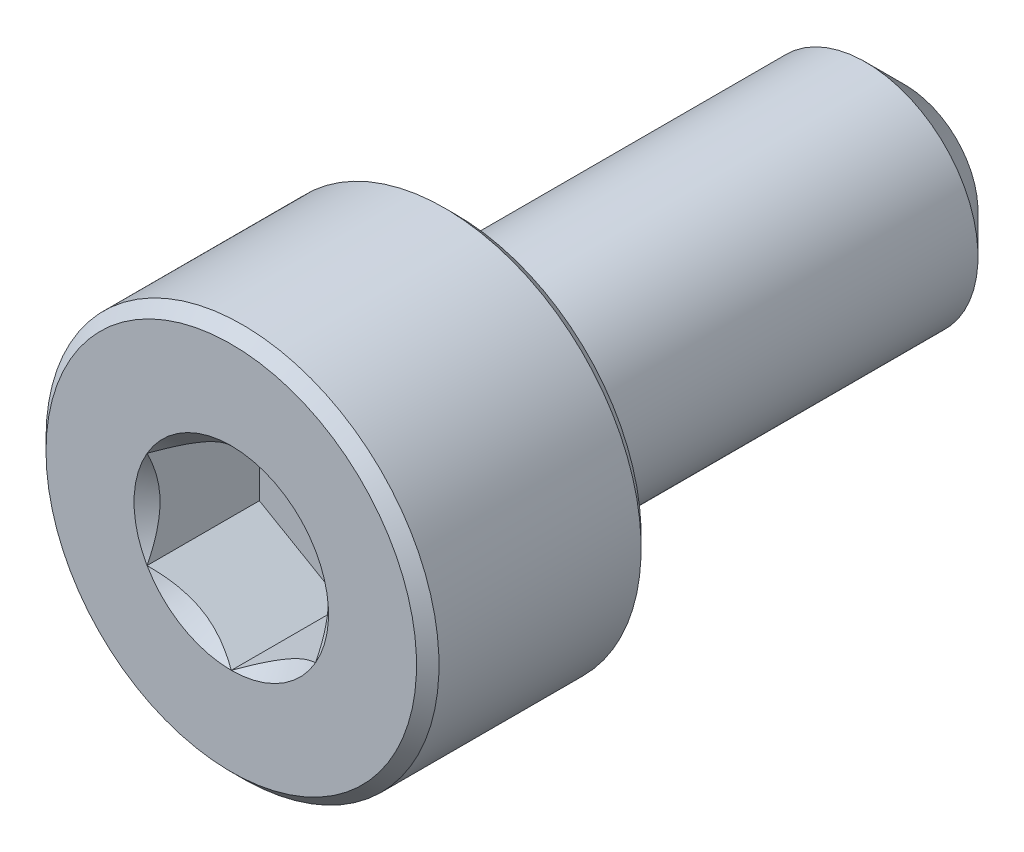
ISO-10303-21;
HEADER;
FILE_DESCRIPTION(('STEP AP214'),'2;1');
FILE_NAME('part.step','',(''),(''),'','','');
FILE_SCHEMA(('AUTOMOTIVE_DESIGN { 1 0 10303 214 1 1 1 1 }'));
ENDSEC;
DATA;
#1=APPLICATION_CONTEXT('core data for automotive mechanical design processes');
#2=APPLICATION_PROTOCOL_DEFINITION('international standard','automotive_design',2000,#1);
#3=PRODUCT_CONTEXT('',#1,'mechanical');
#4=PRODUCT('Part','Part','',(#3));
#5=PRODUCT_RELATED_PRODUCT_CATEGORY('part','',(#4));
#6=PRODUCT_DEFINITION_FORMATION('','',#4);
#7=PRODUCT_DEFINITION_CONTEXT('part definition',#1,'design');
#8=PRODUCT_DEFINITION('design','',#6,#7);
#9=PRODUCT_DEFINITION_SHAPE('','',#8);
#10=(LENGTH_UNIT() NAMED_UNIT(*) SI_UNIT(.MILLI.,.METRE.));
#11=(NAMED_UNIT(*) PLANE_ANGLE_UNIT() SI_UNIT($,.RADIAN.));
#12=(NAMED_UNIT(*) SI_UNIT($,.STERADIAN.) SOLID_ANGLE_UNIT());
#13=UNCERTAINTY_MEASURE_WITH_UNIT(LENGTH_MEASURE(1.E-05),#10,'distance_accuracy_value','');
#14=(GEOMETRIC_REPRESENTATION_CONTEXT(3) GLOBAL_UNCERTAINTY_ASSIGNED_CONTEXT((#13)) GLOBAL_UNIT_ASSIGNED_CONTEXT((#10,
#11,#12)) REPRESENTATION_CONTEXT('',''));
#15=CARTESIAN_POINT('',(0.,0.,0.));
#16=DIRECTION('',(0.,0.,1.));
#17=DIRECTION('',(1.,0.,0.));
#18=AXIS2_PLACEMENT_3D('',#15,#16,#17);
#19=CARTESIAN_POINT('',(0.,3.3,6.));
#20=DIRECTION('',(0.,0.,1.));
#21=DIRECTION('',(1.,0.,0.));
#22=AXIS2_PLACEMENT_3D('',#19,#20,#21);
#23=PLANE('',#22);
#24=CARTESIAN_POINT('',(0.,0.,6.));
#25=DIRECTION('',(0.,0.,1.));
#26=DIRECTION('',(1.,0.,0.));
#27=AXIS2_PLACEMENT_3D('',#24,#25,#26);
#28=CIRCLE('',#27,1.73205080756888);
#29=CARTESIAN_POINT('',(1.5,0.86602540378444,6.));
#30=VERTEX_POINT('',#29);
#31=CARTESIAN_POINT('',(0.,1.73205080756888,6.));
#32=VERTEX_POINT('',#31);
#33=EDGE_CURVE('E93',#30,#32,#28,.T.);
#34=ORIENTED_EDGE('',*,*,#33,.F.);
#35=CARTESIAN_POINT('',(1.5,-0.86602540378444,6.));
#36=VERTEX_POINT('',#35);
#37=EDGE_CURVE('E53',#36,#30,#28,.T.);
#38=ORIENTED_EDGE('',*,*,#37,.F.);
#39=CARTESIAN_POINT('',(0.,-1.73205080756888,6.));
#40=VERTEX_POINT('',#39);
#41=EDGE_CURVE('E279',#40,#36,#28,.T.);
#42=ORIENTED_EDGE('',*,*,#41,.F.);
#43=CARTESIAN_POINT('',(-1.5,-0.866025403784437,6.));
#44=VERTEX_POINT('',#43);
#45=EDGE_CURVE('E60',#44,#40,#28,.T.);
#46=ORIENTED_EDGE('',*,*,#45,.F.);
#47=CARTESIAN_POINT('',(-1.5,0.86602540378444,6.));
#48=VERTEX_POINT('',#47);
#49=EDGE_CURVE('E129',#48,#44,#28,.T.);
#50=ORIENTED_EDGE('',*,*,#49,.F.);
#51=EDGE_CURVE('E102',#32,#48,#28,.T.);
#52=ORIENTED_EDGE('',*,*,#51,.F.);
#53=EDGE_LOOP('',(#34,#38,#42,#46,#50,#52));
#54=FACE_BOUND('',#53,.T.);
#55=CARTESIAN_POINT('',(0.,0.,6.));
#56=DIRECTION('',(0.,0.,-1.));
#57=DIRECTION('',(-1.,0.,0.));
#58=AXIS2_PLACEMENT_3D('',#55,#56,#57);
#59=CIRCLE('',#58,3.3);
#60=CARTESIAN_POINT('',(-3.3,0.,6.));
#61=VERTEX_POINT('',#60);
#62=EDGE_CURVE('E47',#61,#61,#59,.T.);
#63=ORIENTED_EDGE('',*,*,#62,.F.);
#64=EDGE_LOOP('',(#63));
#65=FACE_BOUND('',#64,.T.);
#66=ADVANCED_FACE('F34',(#54,#65),#23,.T.);
#67=CARTESIAN_POINT('',(0.,0.,5.8));
#68=DIRECTION('',(0.,0.,-1.));
#69=DIRECTION('',(-1.,0.,0.));
#70=AXIS2_PLACEMENT_3D('',#67,#68,#69);
#71=CONICAL_SURFACE('',#70,3.5,0.785398163397445);
#72=ORIENTED_EDGE('',*,*,#62,.T.);
#73=EDGE_LOOP('',(#72));
#74=FACE_BOUND('',#73,.T.);
#75=CARTESIAN_POINT('',(0.,0.,5.8));
#76=DIRECTION('',(0.,0.,-1.));
#77=DIRECTION('',(-1.,0.,0.));
#78=AXIS2_PLACEMENT_3D('',#75,#76,#77);
#79=CIRCLE('',#78,3.5);
#80=CARTESIAN_POINT('',(-3.5,0.,5.8));
#81=VERTEX_POINT('',#80);
#82=EDGE_CURVE('E213',#81,#81,#79,.T.);
#83=ORIENTED_EDGE('',*,*,#82,.F.);
#84=EDGE_LOOP('',(#83));
#85=FACE_BOUND('',#84,.T.);
#86=ADVANCED_FACE('F218',(#74,#85),#71,.T.);
#87=CARTESIAN_POINT('',(0.,0.,-6.));
#88=DIRECTION('',(0.,0.,-1.));
#89=DIRECTION('',(-1.,0.,0.));
#90=AXIS2_PLACEMENT_3D('',#87,#88,#89);
#91=CYLINDRICAL_SURFACE('',#90,3.5);
#92=ORIENTED_EDGE('',*,*,#82,.T.);
#93=EDGE_LOOP('',(#92));
#94=FACE_BOUND('',#93,.T.);
#95=CARTESIAN_POINT('',(0.,0.,2.2));
#96=DIRECTION('',(0.,0.,-1.));
#97=DIRECTION('',(-1.,0.,0.));
#98=AXIS2_PLACEMENT_3D('',#95,#96,#97);
#99=CIRCLE('',#98,3.5);
#100=CARTESIAN_POINT('',(-3.5,0.,2.2));
#101=VERTEX_POINT('',#100);
#102=EDGE_CURVE('E210',#101,#101,#99,.T.);
#103=ORIENTED_EDGE('',*,*,#102,.F.);
#104=EDGE_LOOP('',(#103));
#105=FACE_BOUND('',#104,.T.);
#106=ADVANCED_FACE('F224',(#94,#105),#91,.T.);
#107=CARTESIAN_POINT('',(0.,0.,2.));
#108=DIRECTION('',(0.,0.,1.));
#109=DIRECTION('',(1.,0.,0.));
#110=AXIS2_PLACEMENT_3D('',#107,#108,#109);
#111=CONICAL_SURFACE('',#110,3.3,0.785398163397447);
#112=ORIENTED_EDGE('',*,*,#102,.T.);
#113=EDGE_LOOP('',(#112));
#114=FACE_BOUND('',#113,.T.);
#115=CARTESIAN_POINT('',(0.,0.,2.));
#116=DIRECTION('',(0.,0.,-1.));
#117=DIRECTION('',(-1.,0.,0.));
#118=AXIS2_PLACEMENT_3D('',#115,#116,#117);
#119=CIRCLE('',#118,3.3);
#120=CARTESIAN_POINT('',(-3.3,0.,2.));
#121=VERTEX_POINT('',#120);
#122=EDGE_CURVE('E207',#121,#121,#119,.T.);
#123=ORIENTED_EDGE('',*,*,#122,.F.);
#124=EDGE_LOOP('',(#123));
#125=FACE_BOUND('',#124,.T.);
#126=ADVANCED_FACE('F228',(#114,#125),#111,.T.);
#127=CARTESIAN_POINT('',(0.,3.3,2.));
#128=DIRECTION('',(0.,0.,-1.));
#129=DIRECTION('',(-1.,0.,0.));
#130=AXIS2_PLACEMENT_3D('',#127,#128,#129);
#131=PLANE('',#130);
#132=ORIENTED_EDGE('',*,*,#122,.T.);
#133=EDGE_LOOP('',(#132));
#134=FACE_BOUND('',#133,.T.);
#135=CARTESIAN_POINT('',(0.,0.,2.));
#136=DIRECTION('',(0.,0.,-1.));
#137=DIRECTION('',(-1.,0.,0.));
#138=AXIS2_PLACEMENT_3D('',#135,#136,#137);
#139=CIRCLE('',#138,2.);
#140=CARTESIAN_POINT('',(-2.,0.,2.));
#141=VERTEX_POINT('',#140);
#142=EDGE_CURVE('E204',#141,#141,#139,.T.);
#143=ORIENTED_EDGE('',*,*,#142,.F.);
#144=EDGE_LOOP('',(#143));
#145=FACE_BOUND('',#144,.T.);
#146=ADVANCED_FACE('F234',(#134,#145),#131,.T.);
#147=CARTESIAN_POINT('',(0.,0.,-6.));
#148=DIRECTION('',(0.,0.,-1.));
#149=DIRECTION('',(-1.,0.,0.));
#150=AXIS2_PLACEMENT_3D('',#147,#148,#149);
#151=CYLINDRICAL_SURFACE('',#150,2.);
#152=ORIENTED_EDGE('',*,*,#142,.T.);
#153=EDGE_LOOP('',(#152));
#154=FACE_BOUND('',#153,.T.);
#155=CARTESIAN_POINT('',(0.,0.,-5.29999999999999));
#156=DIRECTION('',(0.,0.,-1.));
#157=DIRECTION('',(-1.,0.,0.));
#158=AXIS2_PLACEMENT_3D('',#155,#156,#157);
#159=CIRCLE('',#158,2.);
#160=CARTESIAN_POINT('',(-2.,0.,-5.29999999999999));
#161=VERTEX_POINT('',#160);
#162=EDGE_CURVE('E201',#161,#161,#159,.T.);
#163=ORIENTED_EDGE('',*,*,#162,.F.);
#164=EDGE_LOOP('',(#163));
#165=FACE_BOUND('',#164,.T.);
#166=ADVANCED_FACE('F238',(#154,#165),#151,.T.);
#167=CARTESIAN_POINT('',(0.,0.,-6.));
#168=DIRECTION('',(0.,0.,1.));
#169=DIRECTION('',(1.,0.,0.));
#170=AXIS2_PLACEMENT_3D('',#167,#168,#169);
#171=CONICAL_SURFACE('',#170,1.3,0.785398163397443);
#172=ORIENTED_EDGE('',*,*,#162,.T.);
#173=EDGE_LOOP('',(#172));
#174=FACE_BOUND('',#173,.T.);
#175=CARTESIAN_POINT('',(0.,0.,-6.));
#176=DIRECTION('',(0.,0.,-1.));
#177=DIRECTION('',(-1.,0.,0.));
#178=AXIS2_PLACEMENT_3D('',#175,#176,#177);
#179=CIRCLE('',#178,1.3);
#180=CARTESIAN_POINT('',(-1.3,0.,-6.));
#181=VERTEX_POINT('',#180);
#182=EDGE_CURVE('E189',#181,#181,#179,.T.);
#183=ORIENTED_EDGE('',*,*,#182,.F.);
#184=EDGE_LOOP('',(#183));
#185=FACE_BOUND('',#184,.T.);
#186=ADVANCED_FACE('F241',(#174,#185),#171,.T.);
#187=CARTESIAN_POINT('',(0.,1.3,-6.));
#188=DIRECTION('',(0.,0.,-1.));
#189=DIRECTION('',(-1.,0.,0.));
#190=AXIS2_PLACEMENT_3D('',#187,#188,#189);
#191=PLANE('',#190);
#192=ORIENTED_EDGE('',*,*,#182,.T.);
#193=EDGE_LOOP('',(#192));
#194=FACE_BOUND('',#193,.T.);
#195=ADVANCED_FACE('F162',(#194),#191,.T.);
#196=CARTESIAN_POINT('',(0.,0.,6.));
#197=DIRECTION('',(0.,0.,1.));
#198=DIRECTION('',(1.,0.,0.));
#199=AXIS2_PLACEMENT_3D('',#196,#197,#198);
#200=CONICAL_SURFACE('',#199,1.73205080756888,0.78539816339745);
#201=ORIENTED_EDGE('',*,*,#51,.T.);
#202=CARTESIAN_POINT('',(0.000200000000000415,1.73216627762272,6.00011548160007));
#203=CARTESIAN_POINT('',(-0.0513677907370752,1.70239359975915,5.97036547606733));
#204=CARTESIAN_POINT('',(-0.1037979176652,1.67212305186355,5.94236248391031));
#205=CARTESIAN_POINT('',(-0.210709034055596,1.61039789003619,5.89108923044014));
#206=CARTESIAN_POINT('',(-0.265200195814661,1.57893740312614,5.86784750504437));
#207=CARTESIAN_POINT('',(-0.375079081357248,1.51549879897987,5.82803372899222));
#208=CARTESIAN_POINT('',(-0.430438809095199,1.4835368452681,5.8113615856709));
#209=CARTESIAN_POINT('',(-0.54237725747715,1.41890915196211,5.7856744568181));
#210=CARTESIAN_POINT('',(-0.598952556553008,1.38624538781118,5.77664029047887));
#211=CARTESIAN_POINT('',(-0.69645538951644,1.329952100953,5.76848908122685));
#212=CARTESIAN_POINT('',(-0.737256908280466,1.30639533311124,5.76728225298922));
#213=CARTESIAN_POINT('',(-0.818787969615858,1.25932335290193,5.76931405716227));
#214=CARTESIAN_POINT('',(-0.85951749431463,1.23580815085313,5.77255367074831));
#215=CARTESIAN_POINT('',(-0.940584402163416,1.18900414978427,5.78329198598196));
#216=CARTESIAN_POINT('',(-0.980921384598288,1.1657155821172,5.79079465301873));
#217=CARTESIAN_POINT('',(-1.06091833691403,1.11952932016335,5.80965161192829));
#218=CARTESIAN_POINT('',(-1.10057800851621,1.09663179808786,5.82100755701859));
#219=CARTESIAN_POINT('',(-1.20216313477448,1.03798159809698,5.85472164759267));
#220=CARTESIAN_POINT('',(-1.26345855370969,1.00259267147465,5.87962184909337));
#221=CARTESIAN_POINT('',(-1.35358562846331,0.950557780604375,5.92165665327158));
#222=CARTESIAN_POINT('',(-1.38328513990772,0.933410759677148,5.9364251535591));
#223=CARTESIAN_POINT('',(-1.44213790138375,0.899432101996407,5.96731056594017));
#224=CARTESIAN_POINT('',(-1.47129140422064,0.88260031928571,5.98342683412171));
#225=CARTESIAN_POINT('',(-1.5002,0.865909933730601,6.00011548160007));
#226=B_SPLINE_CURVE_WITH_KNOTS('',3,(#202,#203,#204,#205,#206,#207,#208,#209,#210,#211,#212,
#213,#214,#215,#216,#217,#218,#219,#220,#221,#222,#223,#224,#225),.UNSPECIFIED.,.F.,.F.,(4,2,2,
2,2,2,2,2,2,2,2,4),(0.,0.199829143693305,0.400822987382389,0.598623720538181,0.795926240188889,
0.937113067959881,1.07833105577193,1.21968061668222,1.36109089931054,1.58570969637565,
1.69770705470964,1.80965120737194),.UNSPECIFIED.);
#227=EDGE_CURVE('E11',#32,#48,#226,.T.);
#228=ORIENTED_EDGE('',*,*,#227,.F.);
#229=EDGE_LOOP('',(#201,#228));
#230=FACE_BOUND('',#229,.T.);
#231=ADVANCED_FACE('F106',(#230),#200,.F.);
#232=ORIENTED_EDGE('',*,*,#49,.T.);
#233=CARTESIAN_POINT('',(-1.5,-1.70094076570699,6.53581150933748));
#234=CARTESIAN_POINT('',(-1.5,-1.65940339844307,6.50466245356307));
#235=CARTESIAN_POINT('',(-1.5,-1.61763176138548,6.47382664603814));
#236=CARTESIAN_POINT('',(-1.5,-1.53352581710889,6.41291005817041));
#237=CARTESIAN_POINT('',(-1.5,-1.49119136858461,6.38282947313436));
#238=CARTESIAN_POINT('',(-1.5,-1.36258344501966,6.29348482963313));
#239=CARTESIAN_POINT('',(-1.5,-1.27533705988673,6.23559781348778));
#240=CARTESIAN_POINT('',(-1.5,-1.09255216894207,6.12219567429685));
#241=CARTESIAN_POINT('',(-1.5,-0.996821581803492,6.06698654757307));
#242=CARTESIAN_POINT('',(-1.5,-0.800613082291591,5.9661637894456));
#243=CARTESIAN_POINT('',(-1.5,-0.700152604862087,5.92051785177961));
#244=CARTESIAN_POINT('',(-1.5,-0.549105960820994,5.86468252969871));
#245=CARTESIAN_POINT('',(-1.5,-0.50070074362804,5.84861439232622));
#246=CARTESIAN_POINT('',(-1.5,-0.40274469507941,5.82036772251469));
#247=CARTESIAN_POINT('',(-1.5,-0.353193782853662,5.80818946555124));
#248=CARTESIAN_POINT('',(-1.5,-0.254057869430008,5.78855091399036));
#249=CARTESIAN_POINT('',(-1.5,-0.204488814603775,5.78101136158588));
#250=CARTESIAN_POINT('',(-1.5,-0.104849462627796,5.77079321692886));
#251=CARTESIAN_POINT('',(-1.5,-0.054779247575758,5.76811384119743));
#252=CARTESIAN_POINT('',(-1.5,0.0436737229088438,5.76780462686181));
#253=CARTESIAN_POINT('',(-1.5,0.0920560164094801,5.77000633072589));
#254=CARTESIAN_POINT('',(-1.5,0.188397733218518,5.77897258823616));
#255=CARTESIAN_POINT('',(-1.5,0.236357072029981,5.78573803359405));
#256=CARTESIAN_POINT('',(-1.5,0.332310053939587,5.80358163901288));
#257=CARTESIAN_POINT('',(-1.5,0.380290051019947,5.81473209678684));
#258=CARTESIAN_POINT('',(-1.5,0.475204866701384,5.84076106187732));
#259=CARTESIAN_POINT('',(-1.5,0.52213978119671,5.85563922560084));
#260=CARTESIAN_POINT('',(-1.5,0.671135849237721,5.90843439268167));
#261=CARTESIAN_POINT('',(-1.5,0.771043708402958,5.95241449643641));
#262=CARTESIAN_POINT('',(-1.5,0.96615432077171,6.05016194816059));
#263=CARTESIAN_POINT('',(-1.5,1.06133841027248,6.10396471049644));
#264=CARTESIAN_POINT('',(-1.5,1.24322962123133,6.21492426634355));
#265=CARTESIAN_POINT('',(-1.5,1.33012275327054,6.27177988846287));
#266=CARTESIAN_POINT('',(-1.5,1.45814294533514,6.35965573982338));
#267=CARTESIAN_POINT('',(-1.5,1.50026316125082,6.38925424362582));
#268=CARTESIAN_POINT('',(-1.5,1.58392901779071,6.44922957252824));
#269=CARTESIAN_POINT('',(-1.5,1.62547481197907,6.47960618316485));
#270=CARTESIAN_POINT('',(-1.5,1.66678158585385,6.51030528702036));
#271=B_SPLINE_CURVE_WITH_KNOTS('',3,(#233,#234,#235,#236,#237,#238,#239,#240,#241,#242,#243,
#244,#245,#246,#247,#248,#249,#250,#251,#252,#253,#254,#255,#256,#257,#258,#259,#260,#261,#262,
#263,#264,#265,#266,#267,#268,#269,#270),.UNSPECIFIED.,.F.,.F.,(4,2,2,2,2,2,2,2,2,2,2,2,2,2,2,2,
2,2,4),(0.,0.155753948201002,0.311547769199354,0.625513832410582,0.956763614654479,
1.28687565594417,1.43975300144579,1.59264117109685,1.74283872260253,1.89301205954152,
2.03808349452257,2.1831832832956,2.33078307442231,2.47836926586908,2.80488410158813,
3.13260026706957,3.44396956433299,3.59840353500356,3.75279538879849),.UNSPECIFIED.);
#272=EDGE_CURVE('E101',#48,#44,#271,.F.);
#273=ORIENTED_EDGE('',*,*,#272,.F.);
#274=EDGE_LOOP('',(#232,#273));
#275=FACE_BOUND('',#274,.T.);
#276=ADVANCED_FACE('F256',(#275),#200,.F.);
#277=ORIENTED_EDGE('',*,*,#45,.T.);
#278=CARTESIAN_POINT('',(-1.5002,-0.865909933730601,6.00011548160007));
#279=CARTESIAN_POINT('',(-1.44863220926292,-0.895682611594166,5.97036547606733));
#280=CARTESIAN_POINT('',(-1.3962020823348,-0.925953159489765,5.94236248391031));
#281=CARTESIAN_POINT('',(-1.2892909659444,-0.987678321317124,5.89108923044014));
#282=CARTESIAN_POINT('',(-1.23479980418534,-1.01913880822717,5.86784750504437));
#283=CARTESIAN_POINT('',(-1.12492091864275,-1.08257741237344,5.82803372899222));
#284=CARTESIAN_POINT('',(-1.0695611909048,-1.11453936608521,5.8113615856709));
#285=CARTESIAN_POINT('',(-0.95762274252285,-1.1791670593912,5.7856744568181));
#286=CARTESIAN_POINT('',(-0.901047443446992,-1.21183082354213,5.77664029047887));
#287=CARTESIAN_POINT('',(-0.80354461048356,-1.26812411040032,5.76848908122685));
#288=CARTESIAN_POINT('',(-0.762743091719535,-1.29168087824208,5.76728225298922));
#289=CARTESIAN_POINT('',(-0.681212030384143,-1.33875285845138,5.76931405716227));
#290=CARTESIAN_POINT('',(-0.640482505685371,-1.36226806050018,5.77255367074831));
#291=CARTESIAN_POINT('',(-0.559415597836585,-1.40907206156905,5.78329198598196));
#292=CARTESIAN_POINT('',(-0.519078615401713,-1.43236062923612,5.79079465301873));
#293=CARTESIAN_POINT('',(-0.439081663085971,-1.47854689118996,5.80965161192829));
#294=CARTESIAN_POINT('',(-0.399421991483793,-1.50144441326545,5.82100755701859));
#295=CARTESIAN_POINT('',(-0.297836865225516,-1.56009461325633,5.85472164759267));
#296=CARTESIAN_POINT('',(-0.236541446290312,-1.59548353987866,5.87962184909337));
#297=CARTESIAN_POINT('',(-0.146414371536687,-1.64751843074894,5.92165665327158));
#298=CARTESIAN_POINT('',(-0.116714860092283,-1.66466545167617,5.9364251535591));
#299=CARTESIAN_POINT('',(-0.0578620986162492,-1.69864410935691,5.96731056594017));
#300=CARTESIAN_POINT('',(-0.028708595779363,-1.71547589206761,5.98342683412171));
#301=CARTESIAN_POINT('',(0.000199999999999664,-1.73216627762272,6.00011548160007));
#302=B_SPLINE_CURVE_WITH_KNOTS('',3,(#278,#279,#280,#281,#282,#283,#284,#285,#286,#287,#288,
#289,#290,#291,#292,#293,#294,#295,#296,#297,#298,#299,#300,#301),.UNSPECIFIED.,.F.,.F.,(4,2,2,
2,2,2,2,2,2,2,2,4),(0.,0.199829143693305,0.400822987382389,0.59862372053818,0.795926240188889,
0.937113067959881,1.07833105577193,1.21968061668222,1.36109089931054,1.58570969637565,
1.69770705470964,1.80965120737194),.UNSPECIFIED.);
#303=EDGE_CURVE('E138',#44,#40,#302,.T.);
#304=ORIENTED_EDGE('',*,*,#303,.F.);
#305=EDGE_LOOP('',(#277,#304));
#306=FACE_BOUND('',#305,.T.);
#307=ADVANCED_FACE('F260',(#306),#200,.F.);
#308=ORIENTED_EDGE('',*,*,#41,.T.);
#309=CARTESIAN_POINT('',(-0.000200000000000533,-1.73216627762272,6.00011548160007));
#310=CARTESIAN_POINT('',(0.0513677907370751,-1.70239359975915,5.97036547606733));
#311=CARTESIAN_POINT('',(0.1037979176652,-1.67212305186355,5.94236248391031));
#312=CARTESIAN_POINT('',(0.210709034055596,-1.61039789003619,5.89108923044014));
#313=CARTESIAN_POINT('',(0.265200195814661,-1.57893740312614,5.86784750504437));
#314=CARTESIAN_POINT('',(0.375079081357248,-1.51549879897987,5.82803372899222));
#315=CARTESIAN_POINT('',(0.430438809095199,-1.4835368452681,5.8113615856709));
#316=CARTESIAN_POINT('',(0.54237725747715,-1.41890915196211,5.7856744568181));
#317=CARTESIAN_POINT('',(0.598952556553008,-1.38624538781118,5.77664029047887));
#318=CARTESIAN_POINT('',(0.696455389516441,-1.329952100953,5.76848908122685));
#319=CARTESIAN_POINT('',(0.737256908280466,-1.30639533311124,5.76728225298922));
#320=CARTESIAN_POINT('',(0.818787969615858,-1.25932335290193,5.76931405716227));
#321=CARTESIAN_POINT('',(0.85951749431463,-1.23580815085313,5.77255367074831));
#322=CARTESIAN_POINT('',(0.940584402163416,-1.18900414978427,5.78329198598196));
#323=CARTESIAN_POINT('',(0.980921384598288,-1.1657155821172,5.79079465301873));
#324=CARTESIAN_POINT('',(1.06091833691403,-1.11952932016335,5.80965161192829));
#325=CARTESIAN_POINT('',(1.10057800851621,-1.09663179808786,5.82100755701859));
#326=CARTESIAN_POINT('',(1.20216313477448,-1.03798159809698,5.85472164759267));
#327=CARTESIAN_POINT('',(1.26345855370969,-1.00259267147465,5.87962184909337));
#328=CARTESIAN_POINT('',(1.35358562846331,-0.950557780604375,5.92165665327158));
#329=CARTESIAN_POINT('',(1.38328513990772,-0.933410759677148,5.9364251535591));
#330=CARTESIAN_POINT('',(1.44213790138375,-0.899432101996408,5.96731056594017));
#331=CARTESIAN_POINT('',(1.47129140422064,-0.882600319285711,5.98342683412171));
#332=CARTESIAN_POINT('',(1.5002,-0.865909933730602,6.00011548160007));
#333=B_SPLINE_CURVE_WITH_KNOTS('',3,(#309,#310,#311,#312,#313,#314,#315,#316,#317,#318,#319,
#320,#321,#322,#323,#324,#325,#326,#327,#328,#329,#330,#331,#332),.UNSPECIFIED.,.F.,.F.,(4,2,2,
2,2,2,2,2,2,2,2,4),(0.,0.199829143693305,0.400822987382389,0.598623720538181,0.79592624018889,
0.937113067959882,1.07833105577193,1.21968061668222,1.36109089931054,1.58570969637565,
1.69770705470964,1.80965120737194),.UNSPECIFIED.);
#334=EDGE_CURVE('E281',#40,#36,#333,.T.);
#335=ORIENTED_EDGE('',*,*,#334,.F.);
#336=EDGE_LOOP('',(#308,#335));
#337=FACE_BOUND('',#336,.T.);
#338=ADVANCED_FACE('F269',(#337),#200,.F.);
#339=ORIENTED_EDGE('',*,*,#37,.T.);
#340=CARTESIAN_POINT('',(1.5,-1.70094076506827,6.53581150885843));
#341=CARTESIAN_POINT('',(1.5,-1.65940339782208,6.50466245310244));
#342=CARTESIAN_POINT('',(1.5,-1.61763176078228,6.47382664559589));
#343=CARTESIAN_POINT('',(1.5,-1.53352581654146,6.41291005776482));
#344=CARTESIAN_POINT('',(1.5,-1.49119136803515,6.38282947274705));
#345=CARTESIAN_POINT('',(1.5,-1.36258344452521,6.29348482930099));
#346=CARTESIAN_POINT('',(1.5,-1.2753370594297,6.23559781319227));
#347=CARTESIAN_POINT('',(1.5,-1.09255216856664,6.1221956740766));
#348=CARTESIAN_POINT('',(1.5,-0.996821581472455,6.06698654739118));
#349=CARTESIAN_POINT('',(1.5,-0.800613082053126,5.96616378933478));
#350=CARTESIAN_POINT('',(1.5,-0.70015260467177,5.92051785170157));
#351=CARTESIAN_POINT('',(1.5,-0.549105960667007,5.86468252964533));
#352=CARTESIAN_POINT('',(1.5,-0.500700743459033,5.8486143922722));
#353=CARTESIAN_POINT('',(1.5,-0.402744694879906,5.82036772246244));
#354=CARTESIAN_POINT('',(1.5,-0.353193782638679,5.80818946550141));
#355=CARTESIAN_POINT('',(1.5,-0.254057869184596,5.78855091394885));
#356=CARTESIAN_POINT('',(1.5,-0.204488814343416,5.78101136155019));
#357=CARTESIAN_POINT('',(1.5,-0.104849462338082,5.77079321690814));
#358=CARTESIAN_POINT('',(1.5,-0.0547792472716355,5.76811384118586));
#359=CARTESIAN_POINT('',(1.5,0.0436737232403031,5.76780462687103));
#360=CARTESIAN_POINT('',(1.5,0.0920560167539034,5.77000633074664));
#361=CARTESIAN_POINT('',(1.5,0.188397733587633,5.77897258828183));
#362=CARTESIAN_POINT('',(1.5,0.236357072410825,5.78573803365309));
#363=CARTESIAN_POINT('',(1.5,0.332310054343575,5.80358163910001));
#364=CARTESIAN_POINT('',(1.5,0.380290051435319,5.81473209688875));
#365=CARTESIAN_POINT('',(1.5,0.475204867138459,5.84076106200917));
#366=CARTESIAN_POINT('',(1.5,0.522139781644104,5.85563922574786));
#367=CARTESIAN_POINT('',(1.5,0.671135849783409,5.90843439290061));
#368=CARTESIAN_POINT('',(1.5,0.77104370903169,5.9524144967216));
#369=CARTESIAN_POINT('',(1.5,0.966154321560162,6.05016194858557));
#370=CARTESIAN_POINT('',(1.5,1.06133841113756,6.103964710995));
#371=CARTESIAN_POINT('',(1.5,1.24322962223427,6.21492426698296));
#372=CARTESIAN_POINT('',(1.5,1.33012275433518,6.2717798891689));
#373=CARTESIAN_POINT('',(1.5,1.45814294649102,6.359655740629));
#374=CARTESIAN_POINT('',(1.5,1.50026316243668,6.38925424446438));
#375=CARTESIAN_POINT('',(1.5,1.58392901903633,6.44922957343262));
#376=CARTESIAN_POINT('',(1.5,1.62547481325447,6.47960618410212));
#377=CARTESIAN_POINT('',(1.5,1.66678158715899,6.51030528799048));
#378=B_SPLINE_CURVE_WITH_KNOTS('',3,(#340,#341,#342,#343,#344,#345,#346,#347,#348,#349,#350,
#351,#352,#353,#354,#355,#356,#357,#358,#359,#360,#361,#362,#363,#364,#365,#366,#367,#368,#369,
#370,#371,#372,#373,#374,#375,#376,#377),.UNSPECIFIED.,.F.,.F.,(4,2,2,2,2,2,2,2,2,2,2,2,2,2,2,2,
2,2,4),(0.,0.155753948125308,0.311547769047944,0.625513832104916,0.956763614176022,
1.28687565529455,1.43975300083938,1.59264117053358,1.74283872208071,1.89301205906115,
2.03808349408246,2.18318328289586,2.33078307406585,2.47836926555587,2.80488410158167,
3.1326002673719,3.44396956489969,3.59840353570064,3.75279538962596),.UNSPECIFIED.);
#379=EDGE_CURVE('E118',#36,#30,#378,.T.);
#380=ORIENTED_EDGE('',*,*,#379,.F.);
#381=EDGE_LOOP('',(#339,#380));
#382=FACE_BOUND('',#381,.T.);
#383=ADVANCED_FACE('F263',(#382),#200,.F.);
#384=ORIENTED_EDGE('',*,*,#33,.T.);
#385=CARTESIAN_POINT('',(1.5002,0.865909933730602,6.00011548160007));
#386=CARTESIAN_POINT('',(1.44863220926292,0.895682611594167,5.97036547606733));
#387=CARTESIAN_POINT('',(1.3962020823348,0.925953159489766,5.94236248391031));
#388=CARTESIAN_POINT('',(1.2892909659444,0.987678321317125,5.89108923044014));
#389=CARTESIAN_POINT('',(1.23479980418534,1.01913880822718,5.86784750504437));
#390=CARTESIAN_POINT('',(1.12492091864275,1.08257741237344,5.82803372899222));
#391=CARTESIAN_POINT('',(1.0695611909048,1.11453936608522,5.8113615856709));
#392=CARTESIAN_POINT('',(0.957622742522849,1.1791670593912,5.7856744568181));
#393=CARTESIAN_POINT('',(0.901047443446991,1.21183082354213,5.77664029047887));
#394=CARTESIAN_POINT('',(0.803544610483559,1.26812411040032,5.76848908122685));
#395=CARTESIAN_POINT('',(0.762743091719533,1.29168087824208,5.76728225298922));
#396=CARTESIAN_POINT('',(0.681212030384141,1.33875285845138,5.76931405716227));
#397=CARTESIAN_POINT('',(0.64048250568537,1.36226806050018,5.77255367074831));
#398=CARTESIAN_POINT('',(0.559415597836583,1.40907206156905,5.78329198598196));
#399=CARTESIAN_POINT('',(0.519078615401711,1.43236062923612,5.79079465301873));
#400=CARTESIAN_POINT('',(0.439081663085969,1.47854689118997,5.80965161192829));
#401=CARTESIAN_POINT('',(0.399421991483792,1.50144441326545,5.82100755701859));
#402=CARTESIAN_POINT('',(0.297836865225515,1.56009461325633,5.85472164759267));
#403=CARTESIAN_POINT('',(0.236541446290311,1.59548353987866,5.87962184909337));
#404=CARTESIAN_POINT('',(0.146414371536687,1.64751843074894,5.92165665327158));
#405=CARTESIAN_POINT('',(0.116714860092283,1.66466545167617,5.9364251535591));
#406=CARTESIAN_POINT('',(0.0578620986162494,1.69864410935691,5.96731056594017));
#407=CARTESIAN_POINT('',(0.028708595779363,1.71547589206761,5.98342683412171));
#408=CARTESIAN_POINT('',(-0.000199999999999924,1.73216627762272,6.00011548160007));
#409=B_SPLINE_CURVE_WITH_KNOTS('',3,(#385,#386,#387,#388,#389,#390,#391,#392,#393,#394,#395,
#396,#397,#398,#399,#400,#401,#402,#403,#404,#405,#406,#407,#408),.UNSPECIFIED.,.F.,.F.,(4,2,2,
2,2,2,2,2,2,2,2,4),(0.,0.199829143693305,0.400822987382388,0.59862372053818,0.795926240188888,
0.93711306795988,1.07833105577193,1.21968061668222,1.36109089931054,1.58570969637565,
1.69770705470963,1.80965120737194),.UNSPECIFIED.);
#410=EDGE_CURVE('E97',#30,#32,#409,.T.);
#411=ORIENTED_EDGE('',*,*,#410,.F.);
#412=EDGE_LOOP('',(#384,#411));
#413=FACE_BOUND('',#412,.T.);
#414=ADVANCED_FACE('F95',(#413),#200,.F.);
#415=CARTESIAN_POINT('',(0.,0.,4.));
#416=DIRECTION('',(0.,0.,1.));
#417=DIRECTION('',(1.,0.,0.));
#418=AXIS2_PLACEMENT_3D('',#415,#416,#417);
#419=PLANE('',#418);
#420=DIRECTION('',(-0.866025403784439,0.5,0.));
#421=VECTOR('',#420,1.);
#422=CARTESIAN_POINT('',(1.5,0.86602540378444,4.));
#423=LINE('',#422,#421);
#424=CARTESIAN_POINT('',(1.5,0.86602540378444,4.));
#425=VERTEX_POINT('',#424);
#426=CARTESIAN_POINT('',(0.,1.73205080756888,4.));
#427=VERTEX_POINT('',#426);
#428=EDGE_CURVE('E117',#425,#427,#423,.T.);
#429=ORIENTED_EDGE('',*,*,#428,.T.);
#430=DIRECTION('',(-0.866025403784439,-0.5,0.));
#431=VECTOR('',#430,1.);
#432=CARTESIAN_POINT('',(0.,1.73205080756888,4.));
#433=LINE('',#432,#431);
#434=CARTESIAN_POINT('',(-1.5,0.866025403784439,4.));
#435=VERTEX_POINT('',#434);
#436=EDGE_CURVE('E122',#427,#435,#433,.T.);
#437=ORIENTED_EDGE('',*,*,#436,.T.);
#438=DIRECTION('',(0.,-1.,0.));
#439=VECTOR('',#438,1.);
#440=CARTESIAN_POINT('',(-1.5,0.866025403784439,4.));
#441=LINE('',#440,#439);
#442=CARTESIAN_POINT('',(-1.5,-0.866025403784439,4.));
#443=VERTEX_POINT('',#442);
#444=EDGE_CURVE('E177',#435,#443,#441,.T.);
#445=ORIENTED_EDGE('',*,*,#444,.T.);
#446=DIRECTION('',(0.866025403784439,-0.5,0.));
#447=VECTOR('',#446,1.);
#448=CARTESIAN_POINT('',(-1.5,-0.866025403784439,4.));
#449=LINE('',#448,#447);
#450=CARTESIAN_POINT('',(0.,-1.73205080756888,4.));
#451=VERTEX_POINT('',#450);
#452=EDGE_CURVE('E180',#443,#451,#449,.T.);
#453=ORIENTED_EDGE('',*,*,#452,.T.);
#454=DIRECTION('',(0.866025403784439,0.5,0.));
#455=VECTOR('',#454,1.);
#456=CARTESIAN_POINT('',(0.,-1.73205080756888,4.));
#457=LINE('',#456,#455);
#458=CARTESIAN_POINT('',(1.5,-0.86602540378444,4.));
#459=VERTEX_POINT('',#458);
#460=EDGE_CURVE('E183',#451,#459,#457,.T.);
#461=ORIENTED_EDGE('',*,*,#460,.T.);
#462=DIRECTION('',(0.,1.,0.));
#463=VECTOR('',#462,1.);
#464=CARTESIAN_POINT('',(1.5,-0.86602540378444,4.));
#465=LINE('',#464,#463);
#466=EDGE_CURVE('E125',#459,#425,#465,.T.);
#467=ORIENTED_EDGE('',*,*,#466,.T.);
#468=EDGE_LOOP('',(#429,#437,#445,#453,#461,#467));
#469=FACE_BOUND('',#468,.T.);
#470=ADVANCED_FACE('F157',(#469),#419,.T.);
#471=CARTESIAN_POINT('',(0.,1.73205080756888,4.));
#472=DIRECTION('',(-0.5,0.866025403784439,0.));
#473=DIRECTION('',(-0.866025403784439,-0.5,0.));
#474=AXIS2_PLACEMENT_3D('',#471,#472,#473);
#475=PLANE('',#474);
#476=DIRECTION('',(0.,0.,1.));
#477=VECTOR('',#476,1.);
#478=CARTESIAN_POINT('',(0.,1.73205080756888,4.));
#479=LINE('',#478,#477);
#480=EDGE_CURVE('E114',#427,#32,#479,.T.);
#481=ORIENTED_EDGE('',*,*,#480,.T.);
#482=ORIENTED_EDGE('',*,*,#227,.T.);
#483=DIRECTION('',(0.,0.,1.));
#484=VECTOR('',#483,1.);
#485=CARTESIAN_POINT('',(-1.5,0.866025403784439,4.));
#486=LINE('',#485,#484);
#487=EDGE_CURVE('E124',#435,#48,#486,.T.);
#488=ORIENTED_EDGE('',*,*,#487,.F.);
#489=ORIENTED_EDGE('',*,*,#436,.F.);
#490=EDGE_LOOP('',(#481,#482,#488,#489));
#491=FACE_BOUND('',#490,.T.);
#492=ADVANCED_FACE('F120',(#491),#475,.F.);
#493=CARTESIAN_POINT('',(-1.5,0.866025403784439,4.));
#494=DIRECTION('',(-1.,0.,0.));
#495=DIRECTION('',(0.,-1.,0.));
#496=AXIS2_PLACEMENT_3D('',#493,#494,#495);
#497=PLANE('',#496);
#498=ORIENTED_EDGE('',*,*,#487,.T.);
#499=ORIENTED_EDGE('',*,*,#272,.T.);
#500=DIRECTION('',(0.,0.,1.));
#501=VECTOR('',#500,1.);
#502=CARTESIAN_POINT('',(-1.5,-0.866025403784439,4.));
#503=LINE('',#502,#501);
#504=EDGE_CURVE('E195',#443,#44,#503,.T.);
#505=ORIENTED_EDGE('',*,*,#504,.F.);
#506=ORIENTED_EDGE('',*,*,#444,.F.);
#507=EDGE_LOOP('',(#498,#499,#505,#506));
#508=FACE_BOUND('',#507,.T.);
#509=ADVANCED_FACE('F147',(#508),#497,.F.);
#510=CARTESIAN_POINT('',(-1.5,-0.866025403784439,4.));
#511=DIRECTION('',(-0.5,-0.866025403784439,0.));
#512=DIRECTION('',(0.866025403784439,-0.5,0.));
#513=AXIS2_PLACEMENT_3D('',#510,#511,#512);
#514=PLANE('',#513);
#515=ORIENTED_EDGE('',*,*,#504,.T.);
#516=ORIENTED_EDGE('',*,*,#303,.T.);
#517=DIRECTION('',(0.,0.,1.));
#518=VECTOR('',#517,1.);
#519=CARTESIAN_POINT('',(0.,-1.73205080756888,4.));
#520=LINE('',#519,#518);
#521=EDGE_CURVE('E192',#451,#40,#520,.T.);
#522=ORIENTED_EDGE('',*,*,#521,.F.);
#523=ORIENTED_EDGE('',*,*,#452,.F.);
#524=EDGE_LOOP('',(#515,#516,#522,#523));
#525=FACE_BOUND('',#524,.T.);
#526=ADVANCED_FACE('F150',(#525),#514,.F.);
#527=CARTESIAN_POINT('',(0.,-1.73205080756888,4.));
#528=DIRECTION('',(0.5,-0.866025403784439,0.));
#529=DIRECTION('',(0.866025403784439,0.5,0.));
#530=AXIS2_PLACEMENT_3D('',#527,#528,#529);
#531=PLANE('',#530);
#532=ORIENTED_EDGE('',*,*,#521,.T.);
#533=ORIENTED_EDGE('',*,*,#334,.T.);
#534=DIRECTION('',(0.,0.,1.));
#535=VECTOR('',#534,1.);
#536=CARTESIAN_POINT('',(1.5,-0.86602540378444,4.));
#537=LINE('',#536,#535);
#538=EDGE_CURVE('E190',#459,#36,#537,.T.);
#539=ORIENTED_EDGE('',*,*,#538,.F.);
#540=ORIENTED_EDGE('',*,*,#460,.F.);
#541=EDGE_LOOP('',(#532,#533,#539,#540));
#542=FACE_BOUND('',#541,.T.);
#543=ADVANCED_FACE('F287',(#542),#531,.F.);
#544=CARTESIAN_POINT('',(1.5,-0.86602540378444,4.));
#545=DIRECTION('',(1.,0.,0.));
#546=DIRECTION('',(0.,0.,-1.));
#547=AXIS2_PLACEMENT_3D('',#544,#545,#546);
#548=PLANE('',#547);
#549=ORIENTED_EDGE('',*,*,#538,.T.);
#550=ORIENTED_EDGE('',*,*,#379,.T.);
#551=DIRECTION('',(0.,0.,1.));
#552=VECTOR('',#551,1.);
#553=CARTESIAN_POINT('',(1.5,0.86602540378444,4.));
#554=LINE('',#553,#552);
#555=EDGE_CURVE('E116',#425,#30,#554,.T.);
#556=ORIENTED_EDGE('',*,*,#555,.F.);
#557=ORIENTED_EDGE('',*,*,#466,.F.);
#558=EDGE_LOOP('',(#549,#550,#556,#557));
#559=FACE_BOUND('',#558,.T.);
#560=ADVANCED_FACE('F161',(#559),#548,.F.);
#561=CARTESIAN_POINT('',(1.5,0.86602540378444,4.));
#562=DIRECTION('',(0.5,0.866025403784439,0.));
#563=DIRECTION('',(-0.866025403784439,0.5,0.));
#564=AXIS2_PLACEMENT_3D('',#561,#562,#563);
#565=PLANE('',#564);
#566=ORIENTED_EDGE('',*,*,#555,.T.);
#567=ORIENTED_EDGE('',*,*,#410,.T.);
#568=ORIENTED_EDGE('',*,*,#480,.F.);
#569=ORIENTED_EDGE('',*,*,#428,.F.);
#570=EDGE_LOOP('',(#566,#567,#568,#569));
#571=FACE_BOUND('',#570,.T.);
#572=ADVANCED_FACE('F112',(#571),#565,.F.);
#573=CLOSED_SHELL('',(#66,#86,#106,#126,#146,#166,#186,#195,#231,#276,#307,#338,#383,#414,#470,
#492,#509,#526,#543,#560,#572));
#574=MANIFOLD_SOLID_BREP('B2',#573);
#575=ADVANCED_BREP_SHAPE_REPRESENTATION('',(#18,#574),#14);
#576=SHAPE_DEFINITION_REPRESENTATION(#9,#575);
ENDSEC;
END-ISO-10303-21;
